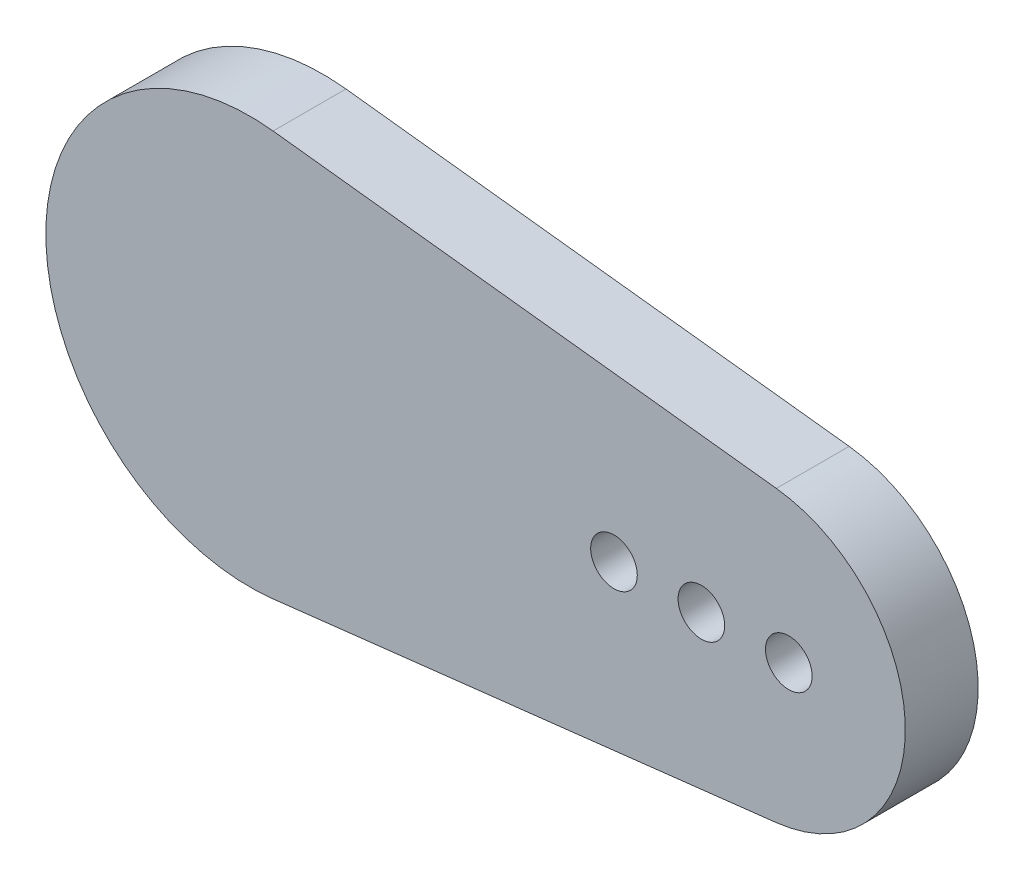
ISO-10303-21;
HEADER;
FILE_DESCRIPTION(('STEP AP214'),'2;1');
FILE_NAME('part.step','',(''),(''),'','','');
FILE_SCHEMA(('AUTOMOTIVE_DESIGN { 1 0 10303 214 1 1 1 1 }'));
ENDSEC;
DATA;
#1=APPLICATION_CONTEXT('core data for automotive mechanical design processes');
#2=APPLICATION_PROTOCOL_DEFINITION('international standard','automotive_design',2000,#1);
#3=PRODUCT_CONTEXT('',#1,'mechanical');
#4=PRODUCT('Part','Part','',(#3));
#5=PRODUCT_RELATED_PRODUCT_CATEGORY('part','',(#4));
#6=PRODUCT_DEFINITION_FORMATION('','',#4);
#7=PRODUCT_DEFINITION_CONTEXT('part definition',#1,'design');
#8=PRODUCT_DEFINITION('design','',#6,#7);
#9=PRODUCT_DEFINITION_SHAPE('','',#8);
#10=(LENGTH_UNIT() NAMED_UNIT(*) SI_UNIT(.MILLI.,.METRE.));
#11=(NAMED_UNIT(*) PLANE_ANGLE_UNIT() SI_UNIT($,.RADIAN.));
#12=(NAMED_UNIT(*) SI_UNIT($,.STERADIAN.) SOLID_ANGLE_UNIT());
#13=UNCERTAINTY_MEASURE_WITH_UNIT(LENGTH_MEASURE(1.E-05),#10,'distance_accuracy_value','');
#14=(GEOMETRIC_REPRESENTATION_CONTEXT(3) GLOBAL_UNCERTAINTY_ASSIGNED_CONTEXT((#13)) GLOBAL_UNIT_ASSIGNED_CONTEXT((#10,
#11,#12)) REPRESENTATION_CONTEXT('',''));
#15=CARTESIAN_POINT('',(0.,0.,0.));
#16=DIRECTION('',(0.,0.,1.));
#17=DIRECTION('',(1.,0.,0.));
#18=AXIS2_PLACEMENT_3D('',#15,#16,#17);
#19=CARTESIAN_POINT('',(0.,0.,2.5));
#20=DIRECTION('',(0.,0.,1.));
#21=DIRECTION('',(1.,0.,0.));
#22=AXIS2_PLACEMENT_3D('',#19,#20,#21);
#23=PLANE('',#22);
#24=CARTESIAN_POINT('',(15.5,0.,2.5));
#25=DIRECTION('',(0.,0.,1.));
#26=DIRECTION('',(1.,0.,0.));
#27=AXIS2_PLACEMENT_3D('',#24,#25,#26);
#28=CIRCLE('',#27,0.800000000000003);
#29=CARTESIAN_POINT('',(16.3,0.,2.5));
#30=VERTEX_POINT('',#29);
#31=EDGE_CURVE('E120',#30,#30,#28,.T.);
#32=ORIENTED_EDGE('',*,*,#31,.F.);
#33=EDGE_LOOP('',(#32));
#34=FACE_BOUND('',#33,.T.);
#35=CARTESIAN_POINT('',(0.,0.,2.5));
#36=DIRECTION('',(0.,0.,1.));
#37=DIRECTION('',(1.,0.,0.));
#38=AXIS2_PLACEMENT_3D('',#35,#36,#37);
#39=CIRCLE('',#38,7.);
#40=CARTESIAN_POINT('',(0.8,6.95413546028549,2.5));
#41=VERTEX_POINT('',#40);
#42=CARTESIAN_POINT('',(0.8,-6.95413546028549,2.5));
#43=VERTEX_POINT('',#42);
#44=EDGE_CURVE('E90',#41,#43,#39,.T.);
#45=ORIENTED_EDGE('',*,*,#44,.T.);
#46=DIRECTION('',(0.993447922897926,0.114285714285714,0.));
#47=VECTOR('',#46,1.);
#48=CARTESIAN_POINT('',(0.8,-6.95413546028549,2.5));
#49=LINE('',#48,#47);
#50=CARTESIAN_POINT('',(18.0714285714286,-4.96723961448963,2.5));
#51=VERTEX_POINT('',#50);
#52=EDGE_CURVE('E85',#43,#51,#49,.T.);
#53=ORIENTED_EDGE('',*,*,#52,.T.);
#54=CARTESIAN_POINT('',(17.5,0.,2.5));
#55=DIRECTION('',(0.,0.,1.));
#56=DIRECTION('',(1.,0.,0.));
#57=AXIS2_PLACEMENT_3D('',#54,#55,#56);
#58=CIRCLE('',#57,5.);
#59=CARTESIAN_POINT('',(18.0714285714286,4.96723961448963,2.5));
#60=VERTEX_POINT('',#59);
#61=EDGE_CURVE('E88',#51,#60,#58,.T.);
#62=ORIENTED_EDGE('',*,*,#61,.T.);
#63=DIRECTION('',(-0.993447922897926,0.114285714285714,0.));
#64=VECTOR('',#63,1.);
#65=CARTESIAN_POINT('',(18.0714285714286,4.96723961448963,2.5));
#66=LINE('',#65,#64);
#67=EDGE_CURVE('E55',#60,#41,#66,.T.);
#68=ORIENTED_EDGE('',*,*,#67,.T.);
#69=EDGE_LOOP('',(#45,#53,#62,#68));
#70=FACE_BOUND('',#69,.T.);
#71=CARTESIAN_POINT('',(12.5,0.,2.5));
#72=DIRECTION('',(0.,0.,1.));
#73=DIRECTION('',(1.,0.,0.));
#74=AXIS2_PLACEMENT_3D('',#71,#72,#73);
#75=CIRCLE('',#74,0.800000000000001);
#76=CARTESIAN_POINT('',(13.3,0.,2.5));
#77=VERTEX_POINT('',#76);
#78=EDGE_CURVE('E105',#77,#77,#75,.T.);
#79=ORIENTED_EDGE('',*,*,#78,.F.);
#80=EDGE_LOOP('',(#79));
#81=FACE_BOUND('',#80,.T.);
#82=CARTESIAN_POINT('',(18.5,0.,2.5));
#83=DIRECTION('',(0.,0.,1.));
#84=DIRECTION('',(1.,0.,0.));
#85=AXIS2_PLACEMENT_3D('',#82,#83,#84);
#86=CIRCLE('',#85,0.799999999999999);
#87=CARTESIAN_POINT('',(19.3,0.,2.5));
#88=VERTEX_POINT('',#87);
#89=EDGE_CURVE('E126',#88,#88,#86,.T.);
#90=ORIENTED_EDGE('',*,*,#89,.F.);
#91=EDGE_LOOP('',(#90));
#92=FACE_BOUND('',#91,.T.);
#93=ADVANCED_FACE('F38',(#34,#70,#81,#92),#23,.T.);
#94=CARTESIAN_POINT('',(0.,0.,0.));
#95=DIRECTION('',(0.,0.,1.));
#96=DIRECTION('',(1.,0.,0.));
#97=AXIS2_PLACEMENT_3D('',#94,#95,#96);
#98=PLANE('',#97);
#99=CARTESIAN_POINT('',(0.,0.,0.));
#100=DIRECTION('',(0.,0.,1.));
#101=DIRECTION('',(1.,0.,0.));
#102=AXIS2_PLACEMENT_3D('',#99,#100,#101);
#103=CIRCLE('',#102,7.);
#104=CARTESIAN_POINT('',(0.8,6.95413546028549,0.));
#105=VERTEX_POINT('',#104);
#106=CARTESIAN_POINT('',(0.8,-6.95413546028549,0.));
#107=VERTEX_POINT('',#106);
#108=EDGE_CURVE('E102',#105,#107,#103,.T.);
#109=ORIENTED_EDGE('',*,*,#108,.F.);
#110=DIRECTION('',(-0.993447922897926,0.114285714285714,0.));
#111=VECTOR('',#110,1.);
#112=CARTESIAN_POINT('',(18.0714285714286,4.96723961448963,0.));
#113=LINE('',#112,#111);
#114=CARTESIAN_POINT('',(18.0714285714286,4.96723961448963,0.));
#115=VERTEX_POINT('',#114);
#116=EDGE_CURVE('E78',#115,#105,#113,.T.);
#117=ORIENTED_EDGE('',*,*,#116,.F.);
#118=CARTESIAN_POINT('',(17.5,0.,0.));
#119=DIRECTION('',(0.,0.,1.));
#120=DIRECTION('',(1.,0.,0.));
#121=AXIS2_PLACEMENT_3D('',#118,#119,#120);
#122=CIRCLE('',#121,5.);
#123=CARTESIAN_POINT('',(18.0714285714286,-4.96723961448963,0.));
#124=VERTEX_POINT('',#123);
#125=EDGE_CURVE('E72',#124,#115,#122,.T.);
#126=ORIENTED_EDGE('',*,*,#125,.F.);
#127=DIRECTION('',(0.993447922897926,0.114285714285714,0.));
#128=VECTOR('',#127,1.);
#129=CARTESIAN_POINT('',(0.8,-6.95413546028549,0.));
#130=LINE('',#129,#128);
#131=EDGE_CURVE('E94',#107,#124,#130,.T.);
#132=ORIENTED_EDGE('',*,*,#131,.F.);
#133=EDGE_LOOP('',(#109,#117,#126,#132));
#134=FACE_BOUND('',#133,.T.);
#135=CARTESIAN_POINT('',(12.5,0.,0.));
#136=DIRECTION('',(0.,0.,1.));
#137=DIRECTION('',(1.,0.,0.));
#138=AXIS2_PLACEMENT_3D('',#135,#136,#137);
#139=CIRCLE('',#138,0.800000000000001);
#140=CARTESIAN_POINT('',(13.3,0.,0.));
#141=VERTEX_POINT('',#140);
#142=EDGE_CURVE('E117',#141,#141,#139,.T.);
#143=ORIENTED_EDGE('',*,*,#142,.T.);
#144=EDGE_LOOP('',(#143));
#145=FACE_BOUND('',#144,.T.);
#146=CARTESIAN_POINT('',(15.5,0.,0.));
#147=DIRECTION('',(0.,0.,1.));
#148=DIRECTION('',(1.,0.,0.));
#149=AXIS2_PLACEMENT_3D('',#146,#147,#148);
#150=CIRCLE('',#149,0.800000000000003);
#151=CARTESIAN_POINT('',(16.3,0.,0.));
#152=VERTEX_POINT('',#151);
#153=EDGE_CURVE('E123',#152,#152,#150,.T.);
#154=ORIENTED_EDGE('',*,*,#153,.T.);
#155=EDGE_LOOP('',(#154));
#156=FACE_BOUND('',#155,.T.);
#157=CARTESIAN_POINT('',(18.5,0.,0.));
#158=DIRECTION('',(0.,0.,1.));
#159=DIRECTION('',(1.,0.,0.));
#160=AXIS2_PLACEMENT_3D('',#157,#158,#159);
#161=CIRCLE('',#160,0.799999999999999);
#162=CARTESIAN_POINT('',(19.3,0.,0.));
#163=VERTEX_POINT('',#162);
#164=EDGE_CURVE('E129',#163,#163,#161,.T.);
#165=ORIENTED_EDGE('',*,*,#164,.T.);
#166=EDGE_LOOP('',(#165));
#167=FACE_BOUND('',#166,.T.);
#168=ADVANCED_FACE('F113',(#134,#145,#156,#167),#98,.F.);
#169=CARTESIAN_POINT('',(0.,0.,2.5));
#170=DIRECTION('',(0.,0.,-1.));
#171=DIRECTION('',(-1.,0.,0.));
#172=AXIS2_PLACEMENT_3D('',#169,#170,#171);
#173=CYLINDRICAL_SURFACE('',#172,7.);
#174=ORIENTED_EDGE('',*,*,#108,.T.);
#175=DIRECTION('',(0.,0.,-1.));
#176=VECTOR('',#175,1.);
#177=CARTESIAN_POINT('',(0.8,-6.95413546028549,2.5));
#178=LINE('',#177,#176);
#179=EDGE_CURVE('E11',#43,#107,#178,.T.);
#180=ORIENTED_EDGE('',*,*,#179,.F.);
#181=ORIENTED_EDGE('',*,*,#44,.F.);
#182=DIRECTION('',(0.,0.,-1.));
#183=VECTOR('',#182,1.);
#184=CARTESIAN_POINT('',(0.8,6.95413546028549,2.5));
#185=LINE('',#184,#183);
#186=EDGE_CURVE('E98',#41,#105,#185,.T.);
#187=ORIENTED_EDGE('',*,*,#186,.T.);
#188=EDGE_LOOP('',(#174,#180,#181,#187));
#189=FACE_BOUND('',#188,.T.);
#190=ADVANCED_FACE('F40',(#189),#173,.T.);
#191=CARTESIAN_POINT('',(0.8,-6.95413546028549,2.5));
#192=DIRECTION('',(-0.114285714285714,0.993447922897926,0.));
#193=DIRECTION('',(-0.993447922897926,-0.114285714285714,0.));
#194=AXIS2_PLACEMENT_3D('',#191,#192,#193);
#195=PLANE('',#194);
#196=ORIENTED_EDGE('',*,*,#131,.T.);
#197=DIRECTION('',(0.,0.,-1.));
#198=VECTOR('',#197,1.);
#199=CARTESIAN_POINT('',(18.0714285714286,-4.96723961448963,2.5));
#200=LINE('',#199,#198);
#201=EDGE_CURVE('E47',#51,#124,#200,.T.);
#202=ORIENTED_EDGE('',*,*,#201,.F.);
#203=ORIENTED_EDGE('',*,*,#52,.F.);
#204=ORIENTED_EDGE('',*,*,#179,.T.);
#205=EDGE_LOOP('',(#196,#202,#203,#204));
#206=FACE_BOUND('',#205,.T.);
#207=ADVANCED_FACE('F93',(#206),#195,.F.);
#208=CARTESIAN_POINT('',(17.5,0.,2.5));
#209=DIRECTION('',(0.,0.,-1.));
#210=DIRECTION('',(-1.,0.,0.));
#211=AXIS2_PLACEMENT_3D('',#208,#209,#210);
#212=CYLINDRICAL_SURFACE('',#211,5.);
#213=ORIENTED_EDGE('',*,*,#125,.T.);
#214=DIRECTION('',(0.,0.,-1.));
#215=VECTOR('',#214,1.);
#216=CARTESIAN_POINT('',(18.0714285714286,4.96723961448963,2.5));
#217=LINE('',#216,#215);
#218=EDGE_CURVE('E95',#60,#115,#217,.T.);
#219=ORIENTED_EDGE('',*,*,#218,.F.);
#220=ORIENTED_EDGE('',*,*,#61,.F.);
#221=ORIENTED_EDGE('',*,*,#201,.T.);
#222=EDGE_LOOP('',(#213,#219,#220,#221));
#223=FACE_BOUND('',#222,.T.);
#224=ADVANCED_FACE('F96',(#223),#212,.T.);
#225=CARTESIAN_POINT('',(18.0714285714286,4.96723961448963,2.5));
#226=DIRECTION('',(-0.114285714285714,-0.993447922897926,0.));
#227=DIRECTION('',(0.993447922897926,-0.114285714285714,0.));
#228=AXIS2_PLACEMENT_3D('',#225,#226,#227);
#229=PLANE('',#228);
#230=ORIENTED_EDGE('',*,*,#116,.T.);
#231=ORIENTED_EDGE('',*,*,#186,.F.);
#232=ORIENTED_EDGE('',*,*,#67,.F.);
#233=ORIENTED_EDGE('',*,*,#218,.T.);
#234=EDGE_LOOP('',(#230,#231,#232,#233));
#235=FACE_BOUND('',#234,.T.);
#236=ADVANCED_FACE('F110',(#235),#229,.F.);
#237=CARTESIAN_POINT('',(12.5,0.,2.5));
#238=DIRECTION('',(0.,0.,-1.));
#239=DIRECTION('',(-1.,0.,0.));
#240=AXIS2_PLACEMENT_3D('',#237,#238,#239);
#241=CYLINDRICAL_SURFACE('',#240,0.800000000000001);
#242=ORIENTED_EDGE('',*,*,#78,.T.);
#243=EDGE_LOOP('',(#242));
#244=FACE_BOUND('',#243,.T.);
#245=ORIENTED_EDGE('',*,*,#142,.F.);
#246=EDGE_LOOP('',(#245));
#247=FACE_BOUND('',#246,.T.);
#248=ADVANCED_FACE('F147',(#244,#247),#241,.F.);
#249=CARTESIAN_POINT('',(15.5,0.,2.5));
#250=DIRECTION('',(0.,0.,-1.));
#251=DIRECTION('',(-1.,0.,0.));
#252=AXIS2_PLACEMENT_3D('',#249,#250,#251);
#253=CYLINDRICAL_SURFACE('',#252,0.800000000000003);
#254=ORIENTED_EDGE('',*,*,#31,.T.);
#255=EDGE_LOOP('',(#254));
#256=FACE_BOUND('',#255,.T.);
#257=ORIENTED_EDGE('',*,*,#153,.F.);
#258=EDGE_LOOP('',(#257));
#259=FACE_BOUND('',#258,.T.);
#260=ADVANCED_FACE('F193',(#256,#259),#253,.F.);
#261=CARTESIAN_POINT('',(18.5,0.,2.5));
#262=DIRECTION('',(0.,0.,-1.));
#263=DIRECTION('',(-1.,0.,0.));
#264=AXIS2_PLACEMENT_3D('',#261,#262,#263);
#265=CYLINDRICAL_SURFACE('',#264,0.799999999999999);
#266=ORIENTED_EDGE('',*,*,#89,.T.);
#267=EDGE_LOOP('',(#266));
#268=FACE_BOUND('',#267,.T.);
#269=ORIENTED_EDGE('',*,*,#164,.F.);
#270=EDGE_LOOP('',(#269));
#271=FACE_BOUND('',#270,.T.);
#272=ADVANCED_FACE('F135',(#268,#271),#265,.F.);
#273=CLOSED_SHELL('',(#93,#168,#190,#207,#224,#236,#248,#260,#272));
#274=MANIFOLD_SOLID_BREP('B2',#273);
#275=ADVANCED_BREP_SHAPE_REPRESENTATION('',(#18,#274),#14);
#276=SHAPE_DEFINITION_REPRESENTATION(#9,#275);
ENDSEC;
END-ISO-10303-21;
